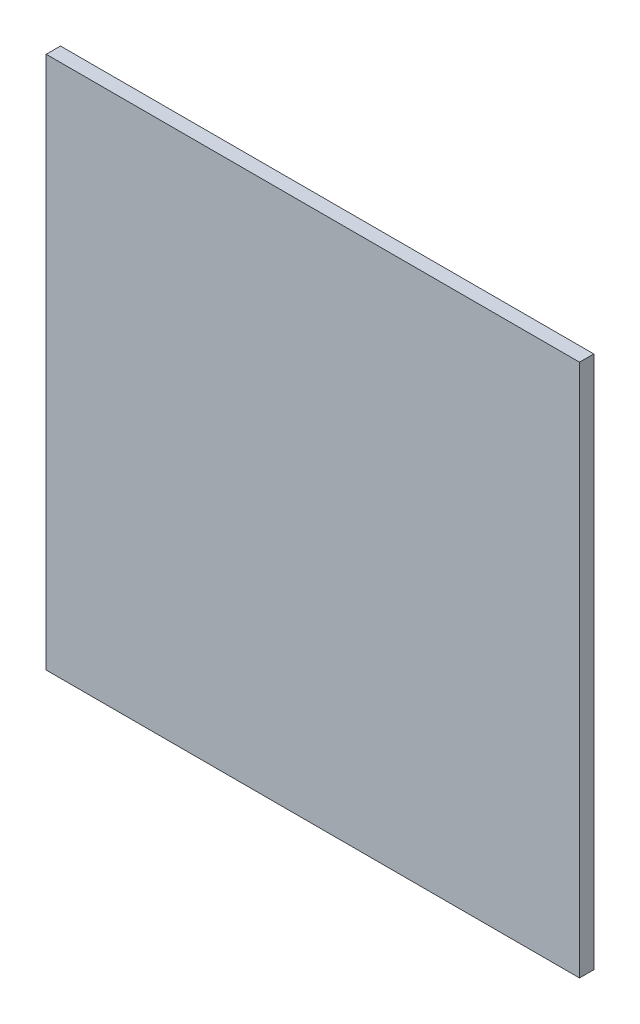
ISO-10303-21;
HEADER;
FILE_DESCRIPTION(('STEP AP214'),'2;1');
FILE_NAME('part.step','',(''),(''),'','','');
FILE_SCHEMA(('AUTOMOTIVE_DESIGN { 1 0 10303 214 1 1 1 1 }'));
ENDSEC;
DATA;
#1=APPLICATION_CONTEXT('core data for automotive mechanical design processes');
#2=APPLICATION_PROTOCOL_DEFINITION('international standard','automotive_design',2000,#1);
#3=PRODUCT_CONTEXT('',#1,'mechanical');
#4=PRODUCT('Part','Part','',(#3));
#5=PRODUCT_RELATED_PRODUCT_CATEGORY('part','',(#4));
#6=PRODUCT_DEFINITION_FORMATION('','',#4);
#7=PRODUCT_DEFINITION_CONTEXT('part definition',#1,'design');
#8=PRODUCT_DEFINITION('design','',#6,#7);
#9=PRODUCT_DEFINITION_SHAPE('','',#8);
#10=(LENGTH_UNIT() NAMED_UNIT(*) SI_UNIT(.MILLI.,.METRE.));
#11=(NAMED_UNIT(*) PLANE_ANGLE_UNIT() SI_UNIT($,.RADIAN.));
#12=(NAMED_UNIT(*) SI_UNIT($,.STERADIAN.) SOLID_ANGLE_UNIT());
#13=UNCERTAINTY_MEASURE_WITH_UNIT(LENGTH_MEASURE(1.E-05),#10,'distance_accuracy_value','');
#14=(GEOMETRIC_REPRESENTATION_CONTEXT(3) GLOBAL_UNCERTAINTY_ASSIGNED_CONTEXT((#13)) GLOBAL_UNIT_ASSIGNED_CONTEXT((#10,
#11,#12)) REPRESENTATION_CONTEXT('',''));
#15=CARTESIAN_POINT('',(0.,0.,0.));
#16=DIRECTION('',(0.,0.,1.));
#17=DIRECTION('',(1.,0.,0.));
#18=AXIS2_PLACEMENT_3D('',#15,#16,#17);
#19=CARTESIAN_POINT('',(-28.,28.,1.5));
#20=DIRECTION('',(0.,1.,0.));
#21=DIRECTION('',(0.,0.,1.));
#22=AXIS2_PLACEMENT_3D('',#19,#20,#21);
#23=PLANE('',#22);
#24=DIRECTION('',(1.,0.,0.));
#25=VECTOR('',#24,1.);
#26=CARTESIAN_POINT('',(-28.,28.,0.));
#27=LINE('',#26,#25);
#28=CARTESIAN_POINT('',(-28.,28.,0.));
#29=VERTEX_POINT('',#28);
#30=CARTESIAN_POINT('',(28.,28.,0.));
#31=VERTEX_POINT('',#30);
#32=EDGE_CURVE('E102',#29,#31,#27,.T.);
#33=ORIENTED_EDGE('',*,*,#32,.F.);
#34=DIRECTION('',(0.,0.,-1.));
#35=VECTOR('',#34,1.);
#36=CARTESIAN_POINT('',(-28.,28.,1.5));
#37=LINE('',#36,#35);
#38=CARTESIAN_POINT('',(-28.,28.,1.5));
#39=VERTEX_POINT('',#38);
#40=EDGE_CURVE('E11',#39,#29,#37,.T.);
#41=ORIENTED_EDGE('',*,*,#40,.F.);
#42=DIRECTION('',(1.,0.,0.));
#43=VECTOR('',#42,1.);
#44=CARTESIAN_POINT('',(-28.,28.,1.5));
#45=LINE('',#44,#43);
#46=CARTESIAN_POINT('',(28.,28.,1.5));
#47=VERTEX_POINT('',#46);
#48=EDGE_CURVE('E97',#39,#47,#45,.T.);
#49=ORIENTED_EDGE('',*,*,#48,.T.);
#50=DIRECTION('',(0.,0.,-1.));
#51=VECTOR('',#50,1.);
#52=CARTESIAN_POINT('',(28.,28.,1.5));
#53=LINE('',#52,#51);
#54=EDGE_CURVE('E40',#47,#31,#53,.T.);
#55=ORIENTED_EDGE('',*,*,#54,.T.);
#56=EDGE_LOOP('',(#33,#41,#49,#55));
#57=FACE_BOUND('',#56,.T.);
#58=ADVANCED_FACE('F37',(#57),#23,.T.);
#59=CARTESIAN_POINT('',(-28.,28.,1.5));
#60=DIRECTION('',(1.,0.,0.));
#61=DIRECTION('',(0.,1.,0.));
#62=AXIS2_PLACEMENT_3D('',#59,#60,#61);
#63=PLANE('',#62);
#64=DIRECTION('',(0.,-1.,0.));
#65=VECTOR('',#64,1.);
#66=CARTESIAN_POINT('',(-28.,28.,0.));
#67=LINE('',#66,#65);
#68=CARTESIAN_POINT('',(-28.,-28.,0.));
#69=VERTEX_POINT('',#68);
#70=EDGE_CURVE('E70',#29,#69,#67,.T.);
#71=ORIENTED_EDGE('',*,*,#70,.T.);
#72=DIRECTION('',(0.,0.,-1.));
#73=VECTOR('',#72,1.);
#74=CARTESIAN_POINT('',(-28.,-28.,1.5));
#75=LINE('',#74,#73);
#76=CARTESIAN_POINT('',(-28.,-28.,1.5));
#77=VERTEX_POINT('',#76);
#78=EDGE_CURVE('E46',#77,#69,#75,.T.);
#79=ORIENTED_EDGE('',*,*,#78,.F.);
#80=DIRECTION('',(0.,-1.,0.));
#81=VECTOR('',#80,1.);
#82=CARTESIAN_POINT('',(-28.,28.,1.5));
#83=LINE('',#82,#81);
#84=EDGE_CURVE('E87',#39,#77,#83,.T.);
#85=ORIENTED_EDGE('',*,*,#84,.F.);
#86=ORIENTED_EDGE('',*,*,#40,.T.);
#87=EDGE_LOOP('',(#71,#79,#85,#86));
#88=FACE_BOUND('',#87,.T.);
#89=ADVANCED_FACE('F112',(#88),#63,.F.);
#90=CARTESIAN_POINT('',(-28.,-28.,1.5));
#91=DIRECTION('',(0.,1.,0.));
#92=DIRECTION('',(0.,0.,1.));
#93=AXIS2_PLACEMENT_3D('',#90,#91,#92);
#94=PLANE('',#93);
#95=DIRECTION('',(1.,0.,0.));
#96=VECTOR('',#95,1.);
#97=CARTESIAN_POINT('',(-28.,-28.,0.));
#98=LINE('',#97,#96);
#99=CARTESIAN_POINT('',(28.,-28.,0.));
#100=VERTEX_POINT('',#99);
#101=EDGE_CURVE('E94',#69,#100,#98,.T.);
#102=ORIENTED_EDGE('',*,*,#101,.T.);
#103=DIRECTION('',(0.,0.,-1.));
#104=VECTOR('',#103,1.);
#105=CARTESIAN_POINT('',(28.,-28.,1.5));
#106=LINE('',#105,#104);
#107=CARTESIAN_POINT('',(28.,-28.,1.5));
#108=VERTEX_POINT('',#107);
#109=EDGE_CURVE('E91',#108,#100,#106,.T.);
#110=ORIENTED_EDGE('',*,*,#109,.F.);
#111=DIRECTION('',(1.,0.,0.));
#112=VECTOR('',#111,1.);
#113=CARTESIAN_POINT('',(-28.,-28.,1.5));
#114=LINE('',#113,#112);
#115=EDGE_CURVE('E82',#77,#108,#114,.T.);
#116=ORIENTED_EDGE('',*,*,#115,.F.);
#117=ORIENTED_EDGE('',*,*,#78,.T.);
#118=EDGE_LOOP('',(#102,#110,#116,#117));
#119=FACE_BOUND('',#118,.T.);
#120=ADVANCED_FACE('F92',(#119),#94,.F.);
#121=CARTESIAN_POINT('',(28.,28.,1.5));
#122=DIRECTION('',(1.,0.,0.));
#123=DIRECTION('',(0.,1.,0.));
#124=AXIS2_PLACEMENT_3D('',#121,#122,#123);
#125=PLANE('',#124);
#126=DIRECTION('',(0.,-1.,0.));
#127=VECTOR('',#126,1.);
#128=CARTESIAN_POINT('',(28.,28.,0.));
#129=LINE('',#128,#127);
#130=EDGE_CURVE('E105',#31,#100,#129,.T.);
#131=ORIENTED_EDGE('',*,*,#130,.F.);
#132=ORIENTED_EDGE('',*,*,#54,.F.);
#133=DIRECTION('',(0.,-1.,0.));
#134=VECTOR('',#133,1.);
#135=CARTESIAN_POINT('',(28.,28.,1.5));
#136=LINE('',#135,#134);
#137=EDGE_CURVE('E86',#47,#108,#136,.T.);
#138=ORIENTED_EDGE('',*,*,#137,.T.);
#139=ORIENTED_EDGE('',*,*,#109,.T.);
#140=EDGE_LOOP('',(#131,#132,#138,#139));
#141=FACE_BOUND('',#140,.T.);
#142=ADVANCED_FACE('F96',(#141),#125,.T.);
#143=CARTESIAN_POINT('',(0.,0.,1.5));
#144=DIRECTION('',(0.,0.,-1.));
#145=DIRECTION('',(-1.,0.,0.));
#146=AXIS2_PLACEMENT_3D('',#143,#144,#145);
#147=PLANE('',#146);
#148=ORIENTED_EDGE('',*,*,#48,.F.);
#149=ORIENTED_EDGE('',*,*,#84,.T.);
#150=ORIENTED_EDGE('',*,*,#115,.T.);
#151=ORIENTED_EDGE('',*,*,#137,.F.);
#152=EDGE_LOOP('',(#148,#149,#150,#151));
#153=FACE_BOUND('',#152,.T.);
#154=ADVANCED_FACE('F85',(#153),#147,.F.);
#155=CARTESIAN_POINT('',(0.,0.,0.));
#156=DIRECTION('',(0.,0.,-1.));
#157=DIRECTION('',(-1.,0.,0.));
#158=AXIS2_PLACEMENT_3D('',#155,#156,#157);
#159=PLANE('',#158);
#160=ORIENTED_EDGE('',*,*,#32,.T.);
#161=ORIENTED_EDGE('',*,*,#130,.T.);
#162=ORIENTED_EDGE('',*,*,#101,.F.);
#163=ORIENTED_EDGE('',*,*,#70,.F.);
#164=EDGE_LOOP('',(#160,#161,#162,#163));
#165=FACE_BOUND('',#164,.T.);
#166=ADVANCED_FACE('F110',(#165),#159,.T.);
#167=CLOSED_SHELL('',(#58,#89,#120,#142,#154,#166));
#168=MANIFOLD_SOLID_BREP('B2',#167);
#169=ADVANCED_BREP_SHAPE_REPRESENTATION('',(#18,#168),#14);
#170=SHAPE_DEFINITION_REPRESENTATION(#9,#169);
ENDSEC;
END-ISO-10303-21;
